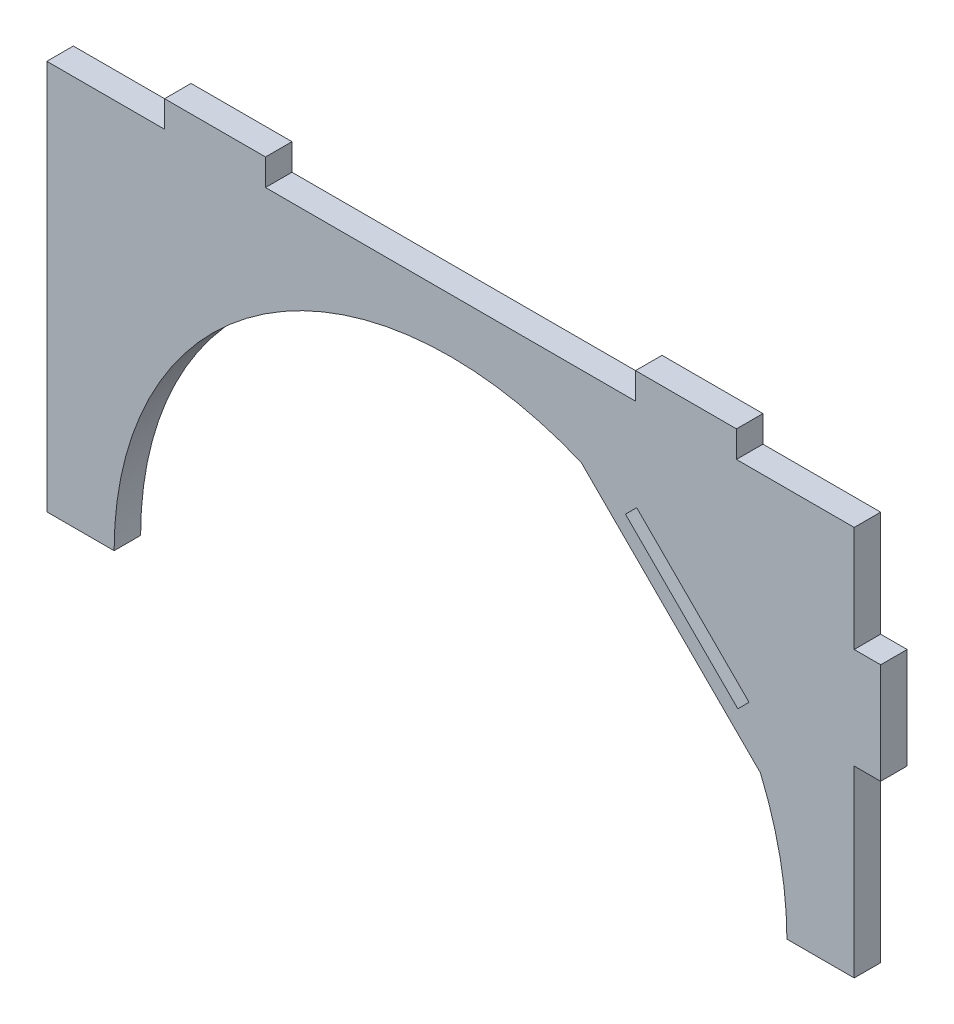
ISO-10303-21;
HEADER;
FILE_DESCRIPTION(('STEP AP214'),'2;1');
FILE_NAME('part.step','',(''),(''),'','','');
FILE_SCHEMA(('AUTOMOTIVE_DESIGN { 1 0 10303 214 1 1 1 1 }'));
ENDSEC;
DATA;
#1=APPLICATION_CONTEXT('core data for automotive mechanical design processes');
#2=APPLICATION_PROTOCOL_DEFINITION('international standard','automotive_design',2000,#1);
#3=PRODUCT_CONTEXT('',#1,'mechanical');
#4=PRODUCT('Part','Part','',(#3));
#5=PRODUCT_RELATED_PRODUCT_CATEGORY('part','',(#4));
#6=PRODUCT_DEFINITION_FORMATION('','',#4);
#7=PRODUCT_DEFINITION_CONTEXT('part definition',#1,'design');
#8=PRODUCT_DEFINITION('design','',#6,#7);
#9=PRODUCT_DEFINITION_SHAPE('','',#8);
#10=(LENGTH_UNIT() NAMED_UNIT(*) SI_UNIT(.MILLI.,.METRE.));
#11=(NAMED_UNIT(*) PLANE_ANGLE_UNIT() SI_UNIT($,.RADIAN.));
#12=(NAMED_UNIT(*) SI_UNIT($,.STERADIAN.) SOLID_ANGLE_UNIT());
#13=UNCERTAINTY_MEASURE_WITH_UNIT(LENGTH_MEASURE(1.E-05),#10,'distance_accuracy_value','');
#14=(GEOMETRIC_REPRESENTATION_CONTEXT(3) GLOBAL_UNCERTAINTY_ASSIGNED_CONTEXT((#13)) GLOBAL_UNIT_ASSIGNED_CONTEXT((#10,
#11,#12)) REPRESENTATION_CONTEXT('',''));
#15=CARTESIAN_POINT('',(0.,0.,0.));
#16=DIRECTION('',(0.,0.,1.));
#17=DIRECTION('',(1.,0.,0.));
#18=AXIS2_PLACEMENT_3D('',#15,#16,#17);
#19=CARTESIAN_POINT('',(0.,0.,0.));
#20=DIRECTION('',(0.,0.,1.));
#21=DIRECTION('',(1.,0.,0.));
#22=AXIS2_PLACEMENT_3D('',#19,#20,#21);
#23=PLANE('',#22);
#24=DIRECTION('',(-0.707106781186544,-0.707106781186551,0.));
#25=VECTOR('',#24,1.);
#26=CARTESIAN_POINT('',(35.1452698484995,198.598473284097,0.));
#27=LINE('',#26,#25);
#28=CARTESIAN_POINT('',(33.0239495049398,196.477152940537,0.));
#29=VERTEX_POINT('',#28);
#30=CARTESIAN_POINT('',(35.1452698484995,198.598473284097,0.));
#31=VERTEX_POINT('',#30);
#32=EDGE_CURVE('E253',#29,#31,#27,.F.);
#33=ORIENTED_EDGE('',*,*,#32,.T.);
#34=DIRECTION('',(-0.707106781186551,0.707106781186544,0.));
#35=VECTOR('',#34,1.);
#36=CARTESIAN_POINT('',(116.871871566298,116.871871566299,0.));
#37=LINE('',#36,#35);
#38=CARTESIAN_POINT('',(56.358473284096,177.3852698485,0.));
#39=VERTEX_POINT('',#38);
#40=EDGE_CURVE('E248',#31,#39,#37,.F.);
#41=ORIENTED_EDGE('',*,*,#40,.T.);
#42=DIRECTION('',(0.707106781186544,0.707106781186551,0.));
#43=VECTOR('',#42,1.);
#44=CARTESIAN_POINT('',(56.358473284096,177.3852698485,0.));
#45=LINE('',#44,#43);
#46=CARTESIAN_POINT('',(54.2371529405364,175.263949504941,0.));
#47=VERTEX_POINT('',#46);
#48=EDGE_CURVE('E243',#39,#47,#45,.F.);
#49=ORIENTED_EDGE('',*,*,#48,.T.);
#50=DIRECTION('',(0.707106781186552,-0.707106781186544,0.));
#51=VECTOR('',#50,1.);
#52=CARTESIAN_POINT('',(114.750551222738,114.750551222739,0.));
#53=LINE('',#52,#51);
#54=EDGE_CURVE('E234',#47,#29,#53,.F.);
#55=ORIENTED_EDGE('',*,*,#54,.T.);
#56=EDGE_LOOP('',(#33,#41,#49,#55));
#57=FACE_BOUND('',#56,.T.);
#58=DIRECTION('',(1.,0.,0.));
#59=VECTOR('',#58,1.);
#60=CARTESIAN_POINT('',(0.,215.9,0.));
#61=LINE('',#60,#59);
#62=CARTESIAN_POINT('',(-34.925,215.9,0.));
#63=VERTEX_POINT('',#62);
#64=CARTESIAN_POINT('',(34.925,215.9,0.));
#65=VERTEX_POINT('',#64);
#66=EDGE_CURVE('E359',#63,#65,#61,.T.);
#67=ORIENTED_EDGE('',*,*,#66,.F.);
#68=DIRECTION('',(0.,1.,0.));
#69=VECTOR('',#68,1.);
#70=CARTESIAN_POINT('',(-34.925,0.,0.));
#71=LINE('',#70,#69);
#72=CARTESIAN_POINT('',(-34.925,220.9,0.));
#73=VERTEX_POINT('',#72);
#74=EDGE_CURVE('E355',#73,#63,#71,.F.);
#75=ORIENTED_EDGE('',*,*,#74,.F.);
#76=DIRECTION('',(1.,0.,0.));
#77=VECTOR('',#76,1.);
#78=CARTESIAN_POINT('',(-53.975,220.9,0.));
#79=LINE('',#78,#77);
#80=CARTESIAN_POINT('',(-53.975,220.9,0.));
#81=VERTEX_POINT('',#80);
#82=EDGE_CURVE('E351',#73,#81,#79,.F.);
#83=ORIENTED_EDGE('',*,*,#82,.T.);
#84=DIRECTION('',(0.,1.,0.));
#85=VECTOR('',#84,1.);
#86=CARTESIAN_POINT('',(-53.9749999999999,0.,0.));
#87=LINE('',#86,#85);
#88=CARTESIAN_POINT('',(-53.975,215.9,0.));
#89=VERTEX_POINT('',#88);
#90=EDGE_CURVE('E258',#81,#89,#87,.F.);
#91=ORIENTED_EDGE('',*,*,#90,.T.);
#92=DIRECTION('',(-1.,0.,0.));
#93=VECTOR('',#92,1.);
#94=CARTESIAN_POINT('',(-5.39251183389362E-13,215.9,0.));
#95=LINE('',#94,#93);
#96=CARTESIAN_POINT('',(-76.2,215.9,0.));
#97=VERTEX_POINT('',#96);
#98=EDGE_CURVE('E218',#97,#89,#95,.F.);
#99=ORIENTED_EDGE('',*,*,#98,.F.);
#100=DIRECTION('',(0.,1.,0.));
#101=VECTOR('',#100,1.);
#102=CARTESIAN_POINT('',(-76.2,0.,0.));
#103=LINE('',#102,#101);
#104=CARTESIAN_POINT('',(-76.2,142.24,0.));
#105=VERTEX_POINT('',#104);
#106=EDGE_CURVE('E205',#97,#105,#103,.F.);
#107=ORIENTED_EDGE('',*,*,#106,.T.);
#108=DIRECTION('',(1.,0.,0.));
#109=VECTOR('',#108,1.);
#110=CARTESIAN_POINT('',(0.,142.24,0.));
#111=LINE('',#110,#109);
#112=CARTESIAN_POINT('',(-63.5,142.24,0.));
#113=VERTEX_POINT('',#112);
#114=EDGE_CURVE('E174',#105,#113,#111,.T.);
#115=ORIENTED_EDGE('',*,*,#114,.T.);
#116=CARTESIAN_POINT('',(0.,142.24,0.));
#117=DIRECTION('',(0.,0.,1.));
#118=DIRECTION('',(1.,0.,0.));
#119=AXIS2_PLACEMENT_3D('',#116,#117,#118);
#120=CIRCLE('',#119,63.5);
#121=CARTESIAN_POINT('',(24.6802785807389,200.747553778782,0.));
#122=VERTEX_POINT('',#121);
#123=EDGE_CURVE('E19',#113,#122,#120,.F.);
#124=ORIENTED_EDGE('',*,*,#123,.T.);
#125=DIRECTION('',(-0.707106781186552,0.707106781186544,0.));
#126=VECTOR('',#125,1.);
#127=CARTESIAN_POINT('',(112.713916179761,112.713916179762,0.));
#128=LINE('',#127,#126);
#129=CARTESIAN_POINT('',(58.5075537787822,166.92027858074,0.));
#130=VERTEX_POINT('',#129);
#131=EDGE_CURVE('E179',#122,#130,#128,.F.);
#132=ORIENTED_EDGE('',*,*,#131,.T.);
#133=CARTESIAN_POINT('',(0.,142.24,0.));
#134=DIRECTION('',(0.,0.,1.));
#135=DIRECTION('',(1.,0.,0.));
#136=AXIS2_PLACEMENT_3D('',#133,#134,#135);
#137=CIRCLE('',#136,63.5);
#138=CARTESIAN_POINT('',(63.5,142.24,0.));
#139=VERTEX_POINT('',#138);
#140=EDGE_CURVE('E191',#130,#139,#137,.F.);
#141=ORIENTED_EDGE('',*,*,#140,.T.);
#142=DIRECTION('',(1.,0.,0.));
#143=VECTOR('',#142,1.);
#144=CARTESIAN_POINT('',(0.,142.24,0.));
#145=LINE('',#144,#143);
#146=CARTESIAN_POINT('',(76.2,142.24,0.));
#147=VERTEX_POINT('',#146);
#148=EDGE_CURVE('E264',#139,#147,#145,.T.);
#149=ORIENTED_EDGE('',*,*,#148,.T.);
#150=DIRECTION('',(0.,1.,0.));
#151=VECTOR('',#150,1.);
#152=CARTESIAN_POINT('',(76.2,0.,0.));
#153=LINE('',#152,#151);
#154=CARTESIAN_POINT('',(76.2,176.895,0.));
#155=VERTEX_POINT('',#154);
#156=EDGE_CURVE('E267',#155,#147,#153,.F.);
#157=ORIENTED_EDGE('',*,*,#156,.F.);
#158=DIRECTION('',(-1.,0.,0.));
#159=VECTOR('',#158,1.);
#160=CARTESIAN_POINT('',(81.2,176.895,0.));
#161=LINE('',#160,#159);
#162=CARTESIAN_POINT('',(81.2,176.895,0.));
#163=VERTEX_POINT('',#162);
#164=EDGE_CURVE('E275',#155,#163,#161,.F.);
#165=ORIENTED_EDGE('',*,*,#164,.T.);
#166=DIRECTION('',(0.,-1.,0.));
#167=VECTOR('',#166,1.);
#168=CARTESIAN_POINT('',(81.2000000000001,0.,0.));
#169=LINE('',#168,#167);
#170=CARTESIAN_POINT('',(81.2,195.945,0.));
#171=VERTEX_POINT('',#170);
#172=EDGE_CURVE('E389',#163,#171,#169,.F.);
#173=ORIENTED_EDGE('',*,*,#172,.T.);
#174=DIRECTION('',(1.,0.,0.));
#175=VECTOR('',#174,1.);
#176=CARTESIAN_POINT('',(81.2,195.945,0.));
#177=LINE('',#176,#175);
#178=CARTESIAN_POINT('',(76.2,195.945,0.));
#179=VERTEX_POINT('',#178);
#180=EDGE_CURVE('E385',#171,#179,#177,.F.);
#181=ORIENTED_EDGE('',*,*,#180,.T.);
#182=DIRECTION('',(0.,1.,0.));
#183=VECTOR('',#182,1.);
#184=CARTESIAN_POINT('',(76.2,0.,0.));
#185=LINE('',#184,#183);
#186=CARTESIAN_POINT('',(76.2,215.9,0.));
#187=VERTEX_POINT('',#186);
#188=EDGE_CURVE('E380',#187,#179,#185,.F.);
#189=ORIENTED_EDGE('',*,*,#188,.F.);
#190=DIRECTION('',(-1.,0.,0.));
#191=VECTOR('',#190,1.);
#192=CARTESIAN_POINT('',(2.69625591694681E-13,215.9,0.));
#193=LINE('',#192,#191);
#194=CARTESIAN_POINT('',(53.975,215.9,0.));
#195=VERTEX_POINT('',#194);
#196=EDGE_CURVE('E378',#195,#187,#193,.F.);
#197=ORIENTED_EDGE('',*,*,#196,.F.);
#198=DIRECTION('',(0.,1.,0.));
#199=VECTOR('',#198,1.);
#200=CARTESIAN_POINT('',(53.975,0.,0.));
#201=LINE('',#200,#199);
#202=CARTESIAN_POINT('',(53.975,220.9,0.));
#203=VERTEX_POINT('',#202);
#204=EDGE_CURVE('E374',#203,#195,#201,.F.);
#205=ORIENTED_EDGE('',*,*,#204,.F.);
#206=DIRECTION('',(1.,0.,0.));
#207=VECTOR('',#206,1.);
#208=CARTESIAN_POINT('',(-53.975,220.9,0.));
#209=LINE('',#208,#207);
#210=CARTESIAN_POINT('',(34.925,220.9,0.));
#211=VERTEX_POINT('',#210);
#212=EDGE_CURVE('E367',#203,#211,#209,.F.);
#213=ORIENTED_EDGE('',*,*,#212,.T.);
#214=DIRECTION('',(0.,1.,0.));
#215=VECTOR('',#214,1.);
#216=CARTESIAN_POINT('',(34.925,0.,0.));
#217=LINE('',#216,#215);
#218=EDGE_CURVE('E361',#211,#65,#217,.F.);
#219=ORIENTED_EDGE('',*,*,#218,.T.);
#220=EDGE_LOOP('',(#67,#75,#83,#91,#99,#107,#115,#124,#132,#141,#149,#157,#165,#173,#181,#189,
#197,#205,#213,#219));
#221=FACE_BOUND('',#220,.T.);
#222=ADVANCED_FACE('F16',(#57,#221),#23,.T.);
#223=CARTESIAN_POINT('',(35.1452698484995,198.598473284097,-5.));
#224=DIRECTION('',(-0.707106781186551,0.707106781186544,0.));
#225=DIRECTION('',(-0.707106781186544,-0.707106781186551,0.));
#226=AXIS2_PLACEMENT_3D('',#223,#224,#225);
#227=PLANE('',#226);
#228=DIRECTION('',(0.707106781186543,0.707106781186552,0.));
#229=VECTOR('',#228,1.);
#230=CARTESIAN_POINT('',(33.0239495049398,196.477152940537,-5.));
#231=LINE('',#230,#229);
#232=CARTESIAN_POINT('',(33.0239495049398,196.477152940537,-5.00000000000001));
#233=VERTEX_POINT('',#232);
#234=CARTESIAN_POINT('',(35.1452698484995,198.598473284097,-5.));
#235=VERTEX_POINT('',#234);
#236=EDGE_CURVE('E261',#233,#235,#231,.T.);
#237=ORIENTED_EDGE('',*,*,#236,.T.);
#238=DIRECTION('',(0.,0.,1.));
#239=VECTOR('',#238,1.);
#240=CARTESIAN_POINT('',(35.1452698484995,198.598473284097,0.));
#241=LINE('',#240,#239);
#242=EDGE_CURVE('E250',#235,#31,#241,.T.);
#243=ORIENTED_EDGE('',*,*,#242,.T.);
#244=ORIENTED_EDGE('',*,*,#32,.F.);
#245=DIRECTION('',(0.,0.,1.));
#246=VECTOR('',#245,1.);
#247=CARTESIAN_POINT('',(33.0239495049398,196.477152940537,47.8389913631995));
#248=LINE('',#247,#246);
#249=EDGE_CURVE('E240',#29,#233,#248,.F.);
#250=ORIENTED_EDGE('',*,*,#249,.T.);
#251=EDGE_LOOP('',(#237,#243,#244,#250));
#252=FACE_BOUND('',#251,.T.);
#253=ADVANCED_FACE('F605',(#252),#227,.F.);
#254=CARTESIAN_POINT('',(116.871871566298,116.871871566299,0.));
#255=DIRECTION('',(0.707106781186544,0.707106781186551,0.));
#256=DIRECTION('',(-0.707106781186551,0.707106781186544,0.));
#257=AXIS2_PLACEMENT_3D('',#254,#255,#256);
#258=PLANE('',#257);
#259=DIRECTION('',(0.,0.,1.));
#260=VECTOR('',#259,1.);
#261=CARTESIAN_POINT('',(56.358473284096,177.3852698485,0.));
#262=LINE('',#261,#260);
#263=CARTESIAN_POINT('',(56.3584732840961,177.3852698485,-5.));
#264=VERTEX_POINT('',#263);
#265=EDGE_CURVE('E245',#264,#39,#262,.T.);
#266=ORIENTED_EDGE('',*,*,#265,.T.);
#267=ORIENTED_EDGE('',*,*,#40,.F.);
#268=ORIENTED_EDGE('',*,*,#242,.F.);
#269=DIRECTION('',(0.707106781186551,-0.707106781186544,0.));
#270=VECTOR('',#269,1.);
#271=CARTESIAN_POINT('',(35.1452698484995,198.598473284097,-5.));
#272=LINE('',#271,#270);
#273=EDGE_CURVE('E343',#235,#264,#272,.T.);
#274=ORIENTED_EDGE('',*,*,#273,.T.);
#275=EDGE_LOOP('',(#266,#267,#268,#274));
#276=FACE_BOUND('',#275,.T.);
#277=ADVANCED_FACE('F613',(#276),#258,.F.);
#278=CARTESIAN_POINT('',(56.358473284096,177.3852698485,0.));
#279=DIRECTION('',(0.707106781186551,-0.707106781186544,0.));
#280=DIRECTION('',(0.707106781186544,0.707106781186551,0.));
#281=AXIS2_PLACEMENT_3D('',#278,#279,#280);
#282=PLANE('',#281);
#283=ORIENTED_EDGE('',*,*,#48,.F.);
#284=ORIENTED_EDGE('',*,*,#265,.F.);
#285=DIRECTION('',(-0.707106781186544,-0.707106781186551,0.));
#286=VECTOR('',#285,1.);
#287=CARTESIAN_POINT('',(56.3584732840961,177.3852698485,-5.));
#288=LINE('',#287,#286);
#289=CARTESIAN_POINT('',(54.2371529405364,175.26394950494,-5.00000000000001));
#290=VERTEX_POINT('',#289);
#291=EDGE_CURVE('E340',#264,#290,#288,.T.);
#292=ORIENTED_EDGE('',*,*,#291,.T.);
#293=DIRECTION('',(0.,0.,1.));
#294=VECTOR('',#293,1.);
#295=CARTESIAN_POINT('',(54.2371529405364,175.26394950494,47.8389913631995));
#296=LINE('',#295,#294);
#297=EDGE_CURVE('E237',#290,#47,#296,.T.);
#298=ORIENTED_EDGE('',*,*,#297,.T.);
#299=EDGE_LOOP('',(#283,#284,#292,#298));
#300=FACE_BOUND('',#299,.T.);
#301=ADVANCED_FACE('F621',(#300),#282,.F.);
#302=CARTESIAN_POINT('',(114.750551222738,114.750551222739,47.8389913631995));
#303=DIRECTION('',(-0.707106781186544,-0.707106781186552,0.));
#304=DIRECTION('',(0.707106781186552,-0.707106781186544,0.));
#305=AXIS2_PLACEMENT_3D('',#302,#303,#304);
#306=PLANE('',#305);
#307=ORIENTED_EDGE('',*,*,#297,.F.);
#308=DIRECTION('',(-0.707106781186551,0.707106781186544,0.));
#309=VECTOR('',#308,1.);
#310=CARTESIAN_POINT('',(54.2371529405364,175.26394950494,-5.));
#311=LINE('',#310,#309);
#312=EDGE_CURVE('E223',#290,#233,#311,.T.);
#313=ORIENTED_EDGE('',*,*,#312,.T.);
#314=ORIENTED_EDGE('',*,*,#249,.F.);
#315=ORIENTED_EDGE('',*,*,#54,.F.);
#316=EDGE_LOOP('',(#307,#313,#314,#315));
#317=FACE_BOUND('',#316,.T.);
#318=ADVANCED_FACE('F630',(#317),#306,.F.);
#319=CARTESIAN_POINT('',(-5.39251183389362E-13,215.9,-5.));
#320=DIRECTION('',(0.,1.,0.));
#321=DIRECTION('',(-1.,0.,0.));
#322=AXIS2_PLACEMENT_3D('',#319,#320,#321);
#323=PLANE('',#322);
#324=DIRECTION('',(1.,0.,0.));
#325=VECTOR('',#324,1.);
#326=CARTESIAN_POINT('',(0.,215.9,-5.));
#327=LINE('',#326,#325);
#328=CARTESIAN_POINT('',(-53.975,215.9,-5.));
#329=VERTEX_POINT('',#328);
#330=CARTESIAN_POINT('',(-76.2,215.9,-5.));
#331=VERTEX_POINT('',#330);
#332=EDGE_CURVE('E212',#329,#331,#327,.F.);
#333=ORIENTED_EDGE('',*,*,#332,.T.);
#334=DIRECTION('',(0.,0.,1.));
#335=VECTOR('',#334,1.);
#336=CARTESIAN_POINT('',(-76.2,215.9,-5.));
#337=LINE('',#336,#335);
#338=EDGE_CURVE('E215',#331,#97,#337,.T.);
#339=ORIENTED_EDGE('',*,*,#338,.T.);
#340=ORIENTED_EDGE('',*,*,#98,.T.);
#341=DIRECTION('',(0.,0.,1.));
#342=VECTOR('',#341,1.);
#343=CARTESIAN_POINT('',(-53.975,215.9,-5.));
#344=LINE('',#343,#342);
#345=EDGE_CURVE('E226',#89,#329,#344,.F.);
#346=ORIENTED_EDGE('',*,*,#345,.T.);
#347=EDGE_LOOP('',(#333,#339,#340,#346));
#348=FACE_BOUND('',#347,.T.);
#349=ADVANCED_FACE('F464',(#348),#323,.T.);
#350=CARTESIAN_POINT('',(-76.2,0.,-5.));
#351=DIRECTION('',(1.,0.,0.));
#352=DIRECTION('',(0.,1.,0.));
#353=AXIS2_PLACEMENT_3D('',#350,#351,#352);
#354=PLANE('',#353);
#355=ORIENTED_EDGE('',*,*,#338,.F.);
#356=DIRECTION('',(0.,1.,0.));
#357=VECTOR('',#356,1.);
#358=CARTESIAN_POINT('',(-76.2,0.,-5.));
#359=LINE('',#358,#357);
#360=CARTESIAN_POINT('',(-76.2,142.24,-5.));
#361=VERTEX_POINT('',#360);
#362=EDGE_CURVE('E208',#331,#361,#359,.F.);
#363=ORIENTED_EDGE('',*,*,#362,.T.);
#364=DIRECTION('',(0.,0.,1.));
#365=VECTOR('',#364,1.);
#366=CARTESIAN_POINT('',(-76.2,142.24,-5.));
#367=LINE('',#366,#365);
#368=EDGE_CURVE('E202',#361,#105,#367,.T.);
#369=ORIENTED_EDGE('',*,*,#368,.T.);
#370=ORIENTED_EDGE('',*,*,#106,.F.);
#371=EDGE_LOOP('',(#355,#363,#369,#370));
#372=FACE_BOUND('',#371,.T.);
#373=ADVANCED_FACE('F467',(#372),#354,.F.);
#374=CARTESIAN_POINT('',(0.,142.24,-5.));
#375=DIRECTION('',(0.,1.,0.));
#376=DIRECTION('',(0.,0.,1.));
#377=AXIS2_PLACEMENT_3D('',#374,#375,#376);
#378=PLANE('',#377);
#379=ORIENTED_EDGE('',*,*,#368,.F.);
#380=DIRECTION('',(1.,0.,0.));
#381=VECTOR('',#380,1.);
#382=CARTESIAN_POINT('',(0.,142.24,-5.));
#383=LINE('',#382,#381);
#384=CARTESIAN_POINT('',(-63.5,142.24,-5.));
#385=VERTEX_POINT('',#384);
#386=EDGE_CURVE('E211',#361,#385,#383,.T.);
#387=ORIENTED_EDGE('',*,*,#386,.T.);
#388=DIRECTION('',(0.,0.,1.));
#389=VECTOR('',#388,1.);
#390=CARTESIAN_POINT('',(-63.5,142.24,-5.));
#391=LINE('',#390,#389);
#392=EDGE_CURVE('E185',#385,#113,#391,.T.);
#393=ORIENTED_EDGE('',*,*,#392,.T.);
#394=ORIENTED_EDGE('',*,*,#114,.F.);
#395=EDGE_LOOP('',(#379,#387,#393,#394));
#396=FACE_BOUND('',#395,.T.);
#397=ADVANCED_FACE('F471',(#396),#378,.F.);
#398=CARTESIAN_POINT('',(0.,142.24,-5.));
#399=DIRECTION('',(0.,0.,1.));
#400=DIRECTION('',(1.,0.,0.));
#401=AXIS2_PLACEMENT_3D('',#398,#399,#400);
#402=CYLINDRICAL_SURFACE('',#401,63.5);
#403=ORIENTED_EDGE('',*,*,#123,.F.);
#404=ORIENTED_EDGE('',*,*,#392,.F.);
#405=CARTESIAN_POINT('',(0.,142.24,-5.));
#406=DIRECTION('',(0.,0.,1.));
#407=DIRECTION('',(1.,0.,0.));
#408=AXIS2_PLACEMENT_3D('',#405,#406,#407);
#409=CIRCLE('',#408,63.5);
#410=CARTESIAN_POINT('',(24.6802785807389,200.747553778782,-5.));
#411=VERTEX_POINT('',#410);
#412=EDGE_CURVE('E196',#385,#411,#409,.F.);
#413=ORIENTED_EDGE('',*,*,#412,.T.);
#414=DIRECTION('',(0.,0.,1.));
#415=VECTOR('',#414,1.);
#416=CARTESIAN_POINT('',(24.6802785807389,200.747553778782,47.8389913631995));
#417=LINE('',#416,#415);
#418=EDGE_CURVE('E184',#411,#122,#417,.T.);
#419=ORIENTED_EDGE('',*,*,#418,.T.);
#420=EDGE_LOOP('',(#403,#404,#413,#419));
#421=FACE_BOUND('',#420,.T.);
#422=ADVANCED_FACE('F194',(#421),#402,.F.);
#423=CARTESIAN_POINT('',(112.713916179761,112.713916179762,47.8389913631995));
#424=DIRECTION('',(0.707106781186544,0.707106781186552,0.));
#425=DIRECTION('',(-0.707106781186552,0.707106781186544,0.));
#426=AXIS2_PLACEMENT_3D('',#423,#424,#425);
#427=PLANE('',#426);
#428=ORIENTED_EDGE('',*,*,#418,.F.);
#429=DIRECTION('',(0.707106781186551,-0.707106781186544,0.));
#430=VECTOR('',#429,1.);
#431=CARTESIAN_POINT('',(24.6802785807389,200.747553778782,-5.));
#432=LINE('',#431,#430);
#433=CARTESIAN_POINT('',(58.5075537787822,166.92027858074,-5.));
#434=VERTEX_POINT('',#433);
#435=EDGE_CURVE('E295',#411,#434,#432,.T.);
#436=ORIENTED_EDGE('',*,*,#435,.T.);
#437=DIRECTION('',(0.,0.,1.));
#438=VECTOR('',#437,1.);
#439=CARTESIAN_POINT('',(58.5075537787822,166.92027858074,-5.));
#440=LINE('',#439,#438);
#441=EDGE_CURVE('E190',#434,#130,#440,.T.);
#442=ORIENTED_EDGE('',*,*,#441,.T.);
#443=ORIENTED_EDGE('',*,*,#131,.F.);
#444=EDGE_LOOP('',(#428,#436,#442,#443));
#445=FACE_BOUND('',#444,.T.);
#446=ADVANCED_FACE('F187',(#445),#427,.F.);
#447=CARTESIAN_POINT('',(0.,142.24,-5.));
#448=DIRECTION('',(0.,0.,1.));
#449=DIRECTION('',(1.,0.,0.));
#450=AXIS2_PLACEMENT_3D('',#447,#448,#449);
#451=CYLINDRICAL_SURFACE('',#450,63.5);
#452=CARTESIAN_POINT('',(0.,142.24,-5.));
#453=DIRECTION('',(0.,0.,1.));
#454=DIRECTION('',(1.,0.,0.));
#455=AXIS2_PLACEMENT_3D('',#452,#453,#454);
#456=CIRCLE('',#455,63.5);
#457=CARTESIAN_POINT('',(63.5,142.24,-5.));
#458=VERTEX_POINT('',#457);
#459=EDGE_CURVE('E291',#434,#458,#456,.F.);
#460=ORIENTED_EDGE('',*,*,#459,.T.);
#461=DIRECTION('',(0.,0.,1.));
#462=VECTOR('',#461,1.);
#463=CARTESIAN_POINT('',(63.5,142.24,-5.));
#464=LINE('',#463,#462);
#465=EDGE_CURVE('E268',#458,#139,#464,.T.);
#466=ORIENTED_EDGE('',*,*,#465,.T.);
#467=ORIENTED_EDGE('',*,*,#140,.F.);
#468=ORIENTED_EDGE('',*,*,#441,.F.);
#469=EDGE_LOOP('',(#460,#466,#467,#468));
#470=FACE_BOUND('',#469,.T.);
#471=ADVANCED_FACE('F472',(#470),#451,.F.);
#472=CARTESIAN_POINT('',(0.,142.24,-5.));
#473=DIRECTION('',(0.,1.,0.));
#474=DIRECTION('',(0.,0.,1.));
#475=AXIS2_PLACEMENT_3D('',#472,#473,#474);
#476=PLANE('',#475);
#477=ORIENTED_EDGE('',*,*,#465,.F.);
#478=DIRECTION('',(1.,0.,0.));
#479=VECTOR('',#478,1.);
#480=CARTESIAN_POINT('',(0.,142.24,-5.));
#481=LINE('',#480,#479);
#482=CARTESIAN_POINT('',(76.2,142.24,-5.));
#483=VERTEX_POINT('',#482);
#484=EDGE_CURVE('E294',#458,#483,#481,.T.);
#485=ORIENTED_EDGE('',*,*,#484,.T.);
#486=DIRECTION('',(0.,0.,1.));
#487=VECTOR('',#486,1.);
#488=CARTESIAN_POINT('',(76.2,142.24,-5.));
#489=LINE('',#488,#487);
#490=EDGE_CURVE('E272',#147,#483,#489,.F.);
#491=ORIENTED_EDGE('',*,*,#490,.F.);
#492=ORIENTED_EDGE('',*,*,#148,.F.);
#493=EDGE_LOOP('',(#477,#485,#491,#492));
#494=FACE_BOUND('',#493,.T.);
#495=ADVANCED_FACE('F326',(#494),#476,.F.);
#496=CARTESIAN_POINT('',(76.2,0.,-5.));
#497=DIRECTION('',(1.,0.,0.));
#498=DIRECTION('',(0.,1.,0.));
#499=AXIS2_PLACEMENT_3D('',#496,#497,#498);
#500=PLANE('',#499);
#501=ORIENTED_EDGE('',*,*,#490,.T.);
#502=DIRECTION('',(0.,1.,0.));
#503=VECTOR('',#502,1.);
#504=CARTESIAN_POINT('',(76.2,0.,-5.));
#505=LINE('',#504,#503);
#506=CARTESIAN_POINT('',(76.2,176.895,-5.));
#507=VERTEX_POINT('',#506);
#508=EDGE_CURVE('E303',#483,#507,#505,.T.);
#509=ORIENTED_EDGE('',*,*,#508,.T.);
#510=DIRECTION('',(0.,0.,1.));
#511=VECTOR('',#510,1.);
#512=CARTESIAN_POINT('',(76.2,176.895,0.));
#513=LINE('',#512,#511);
#514=EDGE_CURVE('E277',#507,#155,#513,.T.);
#515=ORIENTED_EDGE('',*,*,#514,.T.);
#516=ORIENTED_EDGE('',*,*,#156,.T.);
#517=EDGE_LOOP('',(#501,#509,#515,#516));
#518=FACE_BOUND('',#517,.T.);
#519=ADVANCED_FACE('F313',(#518),#500,.T.);
#520=CARTESIAN_POINT('',(81.2,176.895,0.));
#521=DIRECTION('',(0.,1.,0.));
#522=DIRECTION('',(-1.,0.,0.));
#523=AXIS2_PLACEMENT_3D('',#520,#521,#522);
#524=PLANE('',#523);
#525=DIRECTION('',(1.,0.,0.));
#526=VECTOR('',#525,1.);
#527=CARTESIAN_POINT('',(0.,176.895,-5.));
#528=LINE('',#527,#526);
#529=CARTESIAN_POINT('',(81.2,176.895,-5.));
#530=VERTEX_POINT('',#529);
#531=EDGE_CURVE('E306',#507,#530,#528,.T.);
#532=ORIENTED_EDGE('',*,*,#531,.T.);
#533=DIRECTION('',(0.,0.,1.));
#534=VECTOR('',#533,1.);
#535=CARTESIAN_POINT('',(81.2,176.895,0.));
#536=LINE('',#535,#534);
#537=EDGE_CURVE('E282',#530,#163,#536,.T.);
#538=ORIENTED_EDGE('',*,*,#537,.T.);
#539=ORIENTED_EDGE('',*,*,#164,.F.);
#540=ORIENTED_EDGE('',*,*,#514,.F.);
#541=EDGE_LOOP('',(#532,#538,#539,#540));
#542=FACE_BOUND('',#541,.T.);
#543=ADVANCED_FACE('F394',(#542),#524,.F.);
#544=CARTESIAN_POINT('',(81.2000000000001,0.,0.));
#545=DIRECTION('',(-1.,0.,0.));
#546=DIRECTION('',(0.,-1.,0.));
#547=AXIS2_PLACEMENT_3D('',#544,#545,#546);
#548=PLANE('',#547);
#549=DIRECTION('',(0.,0.,1.));
#550=VECTOR('',#549,1.);
#551=CARTESIAN_POINT('',(81.2,195.945,0.));
#552=LINE('',#551,#550);
#553=CARTESIAN_POINT('',(81.2,195.945,-5.));
#554=VERTEX_POINT('',#553);
#555=EDGE_CURVE('E387',#554,#171,#552,.T.);
#556=ORIENTED_EDGE('',*,*,#555,.T.);
#557=ORIENTED_EDGE('',*,*,#172,.F.);
#558=ORIENTED_EDGE('',*,*,#537,.F.);
#559=DIRECTION('',(0.,1.,0.));
#560=VECTOR('',#559,1.);
#561=CARTESIAN_POINT('',(81.2,0.,-5.));
#562=LINE('',#561,#560);
#563=EDGE_CURVE('E398',#530,#554,#562,.T.);
#564=ORIENTED_EDGE('',*,*,#563,.T.);
#565=EDGE_LOOP('',(#556,#557,#558,#564));
#566=FACE_BOUND('',#565,.T.);
#567=ADVANCED_FACE('F397',(#566),#548,.F.);
#568=CARTESIAN_POINT('',(81.2,195.945,0.));
#569=DIRECTION('',(0.,-1.,0.));
#570=DIRECTION('',(1.,0.,0.));
#571=AXIS2_PLACEMENT_3D('',#568,#569,#570);
#572=PLANE('',#571);
#573=ORIENTED_EDGE('',*,*,#180,.F.);
#574=ORIENTED_EDGE('',*,*,#555,.F.);
#575=DIRECTION('',(1.,0.,0.));
#576=VECTOR('',#575,1.);
#577=CARTESIAN_POINT('',(0.,195.945,-5.));
#578=LINE('',#577,#576);
#579=CARTESIAN_POINT('',(76.2,195.945,-5.));
#580=VERTEX_POINT('',#579);
#581=EDGE_CURVE('E402',#554,#580,#578,.F.);
#582=ORIENTED_EDGE('',*,*,#581,.T.);
#583=DIRECTION('',(0.,0.,1.));
#584=VECTOR('',#583,1.);
#585=CARTESIAN_POINT('',(76.2,195.945,-5.));
#586=LINE('',#585,#584);
#587=EDGE_CURVE('E383',#179,#580,#586,.F.);
#588=ORIENTED_EDGE('',*,*,#587,.F.);
#589=EDGE_LOOP('',(#573,#574,#582,#588));
#590=FACE_BOUND('',#589,.T.);
#591=ADVANCED_FACE('F460',(#590),#572,.F.);
#592=CARTESIAN_POINT('',(76.2,0.,-5.));
#593=DIRECTION('',(1.,0.,0.));
#594=DIRECTION('',(0.,1.,0.));
#595=AXIS2_PLACEMENT_3D('',#592,#593,#594);
#596=PLANE('',#595);
#597=DIRECTION('',(0.,0.,1.));
#598=VECTOR('',#597,1.);
#599=CARTESIAN_POINT('',(76.2,215.9,-5.));
#600=LINE('',#599,#598);
#601=CARTESIAN_POINT('',(76.2,215.9,-5.));
#602=VERTEX_POINT('',#601);
#603=EDGE_CURVE('E376',#187,#602,#600,.F.);
#604=ORIENTED_EDGE('',*,*,#603,.F.);
#605=ORIENTED_EDGE('',*,*,#188,.T.);
#606=ORIENTED_EDGE('',*,*,#587,.T.);
#607=DIRECTION('',(0.,1.,0.));
#608=VECTOR('',#607,1.);
#609=CARTESIAN_POINT('',(76.2,0.,-5.));
#610=LINE('',#609,#608);
#611=EDGE_CURVE('E403',#580,#602,#610,.T.);
#612=ORIENTED_EDGE('',*,*,#611,.T.);
#613=EDGE_LOOP('',(#604,#605,#606,#612));
#614=FACE_BOUND('',#613,.T.);
#615=ADVANCED_FACE('F457',(#614),#596,.T.);
#616=CARTESIAN_POINT('',(2.69625591694681E-13,215.9,-5.));
#617=DIRECTION('',(0.,1.,0.));
#618=DIRECTION('',(-1.,0.,0.));
#619=AXIS2_PLACEMENT_3D('',#616,#617,#618);
#620=PLANE('',#619);
#621=DIRECTION('',(1.,0.,0.));
#622=VECTOR('',#621,1.);
#623=CARTESIAN_POINT('',(0.,215.9,-5.));
#624=LINE('',#623,#622);
#625=CARTESIAN_POINT('',(53.975,215.9,-5.));
#626=VERTEX_POINT('',#625);
#627=EDGE_CURVE('E408',#602,#626,#624,.F.);
#628=ORIENTED_EDGE('',*,*,#627,.T.);
#629=DIRECTION('',(0.,0.,-1.));
#630=VECTOR('',#629,1.);
#631=CARTESIAN_POINT('',(53.975,215.9,-5.));
#632=LINE('',#631,#630);
#633=EDGE_CURVE('E372',#195,#626,#632,.T.);
#634=ORIENTED_EDGE('',*,*,#633,.F.);
#635=ORIENTED_EDGE('',*,*,#196,.T.);
#636=ORIENTED_EDGE('',*,*,#603,.T.);
#637=EDGE_LOOP('',(#628,#634,#635,#636));
#638=FACE_BOUND('',#637,.T.);
#639=ADVANCED_FACE('F453',(#638),#620,.T.);
#640=CARTESIAN_POINT('',(53.975,0.,-5.));
#641=DIRECTION('',(1.,0.,0.));
#642=DIRECTION('',(0.,0.,-1.));
#643=AXIS2_PLACEMENT_3D('',#640,#641,#642);
#644=PLANE('',#643);
#645=ORIENTED_EDGE('',*,*,#633,.T.);
#646=DIRECTION('',(0.,1.,0.));
#647=VECTOR('',#646,1.);
#648=CARTESIAN_POINT('',(53.975,0.,-5.));
#649=LINE('',#648,#647);
#650=CARTESIAN_POINT('',(53.975,220.9,-5.));
#651=VERTEX_POINT('',#650);
#652=EDGE_CURVE('E411',#626,#651,#649,.T.);
#653=ORIENTED_EDGE('',*,*,#652,.T.);
#654=DIRECTION('',(0.,0.,-1.));
#655=VECTOR('',#654,1.);
#656=CARTESIAN_POINT('',(53.975,220.9,-5.));
#657=LINE('',#656,#655);
#658=EDGE_CURVE('E369',#651,#203,#657,.F.);
#659=ORIENTED_EDGE('',*,*,#658,.T.);
#660=ORIENTED_EDGE('',*,*,#204,.T.);
#661=EDGE_LOOP('',(#645,#653,#659,#660));
#662=FACE_BOUND('',#661,.T.);
#663=ADVANCED_FACE('F449',(#662),#644,.T.);
#664=CARTESIAN_POINT('',(-53.975,220.9,-5.));
#665=DIRECTION('',(0.,-1.,0.));
#666=DIRECTION('',(0.,0.,-1.));
#667=AXIS2_PLACEMENT_3D('',#664,#665,#666);
#668=PLANE('',#667);
#669=ORIENTED_EDGE('',*,*,#658,.F.);
#670=DIRECTION('',(1.,0.,0.));
#671=VECTOR('',#670,1.);
#672=CARTESIAN_POINT('',(0.,220.9,-5.));
#673=LINE('',#672,#671);
#674=CARTESIAN_POINT('',(34.925,220.9,-5.));
#675=VERTEX_POINT('',#674);
#676=EDGE_CURVE('E414',#651,#675,#673,.F.);
#677=ORIENTED_EDGE('',*,*,#676,.T.);
#678=DIRECTION('',(0.,0.,-1.));
#679=VECTOR('',#678,1.);
#680=CARTESIAN_POINT('',(34.925,220.9,-5.));
#681=LINE('',#680,#679);
#682=EDGE_CURVE('E364',#675,#211,#681,.F.);
#683=ORIENTED_EDGE('',*,*,#682,.T.);
#684=ORIENTED_EDGE('',*,*,#212,.F.);
#685=EDGE_LOOP('',(#669,#677,#683,#684));
#686=FACE_BOUND('',#685,.T.);
#687=ADVANCED_FACE('F445',(#686),#668,.F.);
#688=CARTESIAN_POINT('',(34.925,0.,-5.));
#689=DIRECTION('',(1.,0.,0.));
#690=DIRECTION('',(0.,0.,-1.));
#691=AXIS2_PLACEMENT_3D('',#688,#689,#690);
#692=PLANE('',#691);
#693=ORIENTED_EDGE('',*,*,#682,.F.);
#694=DIRECTION('',(0.,1.,0.));
#695=VECTOR('',#694,1.);
#696=CARTESIAN_POINT('',(34.925,0.,-5.));
#697=LINE('',#696,#695);
#698=CARTESIAN_POINT('',(34.925,215.9,-5.));
#699=VERTEX_POINT('',#698);
#700=EDGE_CURVE('E417',#675,#699,#697,.F.);
#701=ORIENTED_EDGE('',*,*,#700,.T.);
#702=DIRECTION('',(0.,0.,1.));
#703=VECTOR('',#702,1.);
#704=CARTESIAN_POINT('',(34.925,215.9,-5.));
#705=LINE('',#704,#703);
#706=EDGE_CURVE('E357',#65,#699,#705,.F.);
#707=ORIENTED_EDGE('',*,*,#706,.F.);
#708=ORIENTED_EDGE('',*,*,#218,.F.);
#709=EDGE_LOOP('',(#693,#701,#707,#708));
#710=FACE_BOUND('',#709,.T.);
#711=ADVANCED_FACE('F441',(#710),#692,.F.);
#712=CARTESIAN_POINT('',(0.,215.9,-5.));
#713=DIRECTION('',(0.,1.,0.));
#714=DIRECTION('',(0.,0.,1.));
#715=AXIS2_PLACEMENT_3D('',#712,#713,#714);
#716=PLANE('',#715);
#717=DIRECTION('',(1.,0.,0.));
#718=VECTOR('',#717,1.);
#719=CARTESIAN_POINT('',(0.,215.9,-5.));
#720=LINE('',#719,#718);
#721=CARTESIAN_POINT('',(-34.925,215.9,-5.));
#722=VERTEX_POINT('',#721);
#723=EDGE_CURVE('E420',#699,#722,#720,.F.);
#724=ORIENTED_EDGE('',*,*,#723,.T.);
#725=DIRECTION('',(0.,0.,-1.));
#726=VECTOR('',#725,1.);
#727=CARTESIAN_POINT('',(-34.925,215.9,-5.));
#728=LINE('',#727,#726);
#729=EDGE_CURVE('E353',#63,#722,#728,.T.);
#730=ORIENTED_EDGE('',*,*,#729,.F.);
#731=ORIENTED_EDGE('',*,*,#66,.T.);
#732=ORIENTED_EDGE('',*,*,#706,.T.);
#733=EDGE_LOOP('',(#724,#730,#731,#732));
#734=FACE_BOUND('',#733,.T.);
#735=ADVANCED_FACE('F436',(#734),#716,.T.);
#736=CARTESIAN_POINT('',(-34.925,0.,-5.));
#737=DIRECTION('',(1.,0.,0.));
#738=DIRECTION('',(0.,0.,-1.));
#739=AXIS2_PLACEMENT_3D('',#736,#737,#738);
#740=PLANE('',#739);
#741=ORIENTED_EDGE('',*,*,#729,.T.);
#742=DIRECTION('',(0.,1.,0.));
#743=VECTOR('',#742,1.);
#744=CARTESIAN_POINT('',(-34.925,0.,-5.));
#745=LINE('',#744,#743);
#746=CARTESIAN_POINT('',(-34.925,220.9,-5.));
#747=VERTEX_POINT('',#746);
#748=EDGE_CURVE('E423',#722,#747,#745,.T.);
#749=ORIENTED_EDGE('',*,*,#748,.T.);
#750=DIRECTION('',(0.,0.,-1.));
#751=VECTOR('',#750,1.);
#752=CARTESIAN_POINT('',(-34.925,220.9,-5.));
#753=LINE('',#752,#751);
#754=EDGE_CURVE('E229',#747,#73,#753,.F.);
#755=ORIENTED_EDGE('',*,*,#754,.T.);
#756=ORIENTED_EDGE('',*,*,#74,.T.);
#757=EDGE_LOOP('',(#741,#749,#755,#756));
#758=FACE_BOUND('',#757,.T.);
#759=ADVANCED_FACE('F432',(#758),#740,.T.);
#760=CARTESIAN_POINT('',(-53.975,220.9,-5.));
#761=DIRECTION('',(0.,-1.,0.));
#762=DIRECTION('',(0.,0.,-1.));
#763=AXIS2_PLACEMENT_3D('',#760,#761,#762);
#764=PLANE('',#763);
#765=DIRECTION('',(1.,0.,0.));
#766=VECTOR('',#765,1.);
#767=CARTESIAN_POINT('',(0.,220.9,-5.));
#768=LINE('',#767,#766);
#769=CARTESIAN_POINT('',(-53.975,220.9,-5.));
#770=VERTEX_POINT('',#769);
#771=EDGE_CURVE('E25',#747,#770,#768,.F.);
#772=ORIENTED_EDGE('',*,*,#771,.T.);
#773=DIRECTION('',(0.,0.,1.));
#774=VECTOR('',#773,1.);
#775=CARTESIAN_POINT('',(-53.975,220.9,-5.));
#776=LINE('',#775,#774);
#777=EDGE_CURVE('E33',#770,#81,#776,.T.);
#778=ORIENTED_EDGE('',*,*,#777,.T.);
#779=ORIENTED_EDGE('',*,*,#82,.F.);
#780=ORIENTED_EDGE('',*,*,#754,.F.);
#781=EDGE_LOOP('',(#772,#778,#779,#780));
#782=FACE_BOUND('',#781,.T.);
#783=ADVANCED_FACE('F428',(#782),#764,.F.);
#784=CARTESIAN_POINT('',(-53.9749999999999,0.,-5.));
#785=DIRECTION('',(1.,0.,0.));
#786=DIRECTION('',(0.,1.,0.));
#787=AXIS2_PLACEMENT_3D('',#784,#785,#786);
#788=PLANE('',#787);
#789=ORIENTED_EDGE('',*,*,#777,.F.);
#790=DIRECTION('',(0.,1.,0.));
#791=VECTOR('',#790,1.);
#792=CARTESIAN_POINT('',(-53.975,0.,-5.));
#793=LINE('',#792,#791);
#794=EDGE_CURVE('E11',#770,#329,#793,.F.);
#795=ORIENTED_EDGE('',*,*,#794,.T.);
#796=ORIENTED_EDGE('',*,*,#345,.F.);
#797=ORIENTED_EDGE('',*,*,#90,.F.);
#798=EDGE_LOOP('',(#789,#795,#796,#797));
#799=FACE_BOUND('',#798,.T.);
#800=ADVANCED_FACE('F462',(#799),#788,.F.);
#801=CARTESIAN_POINT('',(0.,0.,-5.));
#802=DIRECTION('',(0.,0.,1.));
#803=DIRECTION('',(1.,0.,0.));
#804=AXIS2_PLACEMENT_3D('',#801,#802,#803);
#805=PLANE('',#804);
#806=ORIENTED_EDGE('',*,*,#771,.F.);
#807=ORIENTED_EDGE('',*,*,#748,.F.);
#808=ORIENTED_EDGE('',*,*,#723,.F.);
#809=ORIENTED_EDGE('',*,*,#700,.F.);
#810=ORIENTED_EDGE('',*,*,#676,.F.);
#811=ORIENTED_EDGE('',*,*,#652,.F.);
#812=ORIENTED_EDGE('',*,*,#627,.F.);
#813=ORIENTED_EDGE('',*,*,#611,.F.);
#814=ORIENTED_EDGE('',*,*,#581,.F.);
#815=ORIENTED_EDGE('',*,*,#563,.F.);
#816=ORIENTED_EDGE('',*,*,#531,.F.);
#817=ORIENTED_EDGE('',*,*,#508,.F.);
#818=ORIENTED_EDGE('',*,*,#484,.F.);
#819=ORIENTED_EDGE('',*,*,#459,.F.);
#820=ORIENTED_EDGE('',*,*,#435,.F.);
#821=ORIENTED_EDGE('',*,*,#412,.F.);
#822=ORIENTED_EDGE('',*,*,#386,.F.);
#823=ORIENTED_EDGE('',*,*,#362,.F.);
#824=ORIENTED_EDGE('',*,*,#332,.F.);
#825=ORIENTED_EDGE('',*,*,#794,.F.);
#826=EDGE_LOOP('',(#806,#807,#808,#809,#810,#811,#812,#813,#814,#815,#816,#817,#818,#819,#820,
#821,#822,#823,#824,#825));
#827=FACE_BOUND('',#826,.T.);
#828=ORIENTED_EDGE('',*,*,#291,.F.);
#829=ORIENTED_EDGE('',*,*,#273,.F.);
#830=ORIENTED_EDGE('',*,*,#236,.F.);
#831=ORIENTED_EDGE('',*,*,#312,.F.);
#832=EDGE_LOOP('',(#828,#829,#830,#831));
#833=FACE_BOUND('',#832,.T.);
#834=ADVANCED_FACE('F321',(#827,#833),#805,.F.);
#835=CLOSED_SHELL('',(#222,#253,#277,#301,#318,#349,#373,#397,#422,#446,#471,#495,#519,#543,
#567,#591,#615,#639,#663,#687,#711,#735,#759,#783,#800,#834));
#836=MANIFOLD_SOLID_BREP('B1',#835);
#837=ADVANCED_BREP_SHAPE_REPRESENTATION('',(#18,#836),#14);
#838=SHAPE_DEFINITION_REPRESENTATION(#9,#837);
ENDSEC;
END-ISO-10303-21;
